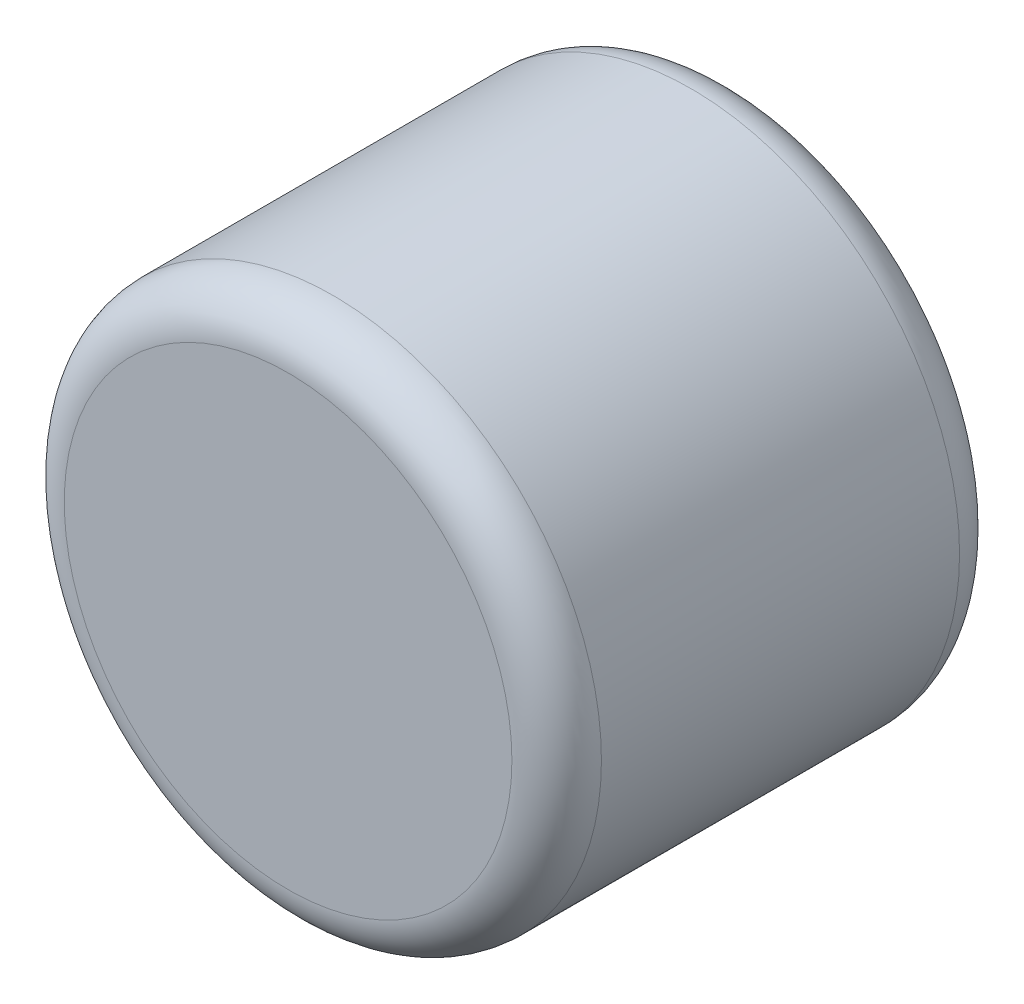
ISO-10303-21;
HEADER;
FILE_DESCRIPTION(('STEP AP214'),'2;1');
FILE_NAME('part.step','',(''),(''),'','','');
FILE_SCHEMA(('AUTOMOTIVE_DESIGN { 1 0 10303 214 1 1 1 1 }'));
ENDSEC;
DATA;
#1=APPLICATION_CONTEXT('core data for automotive mechanical design processes');
#2=APPLICATION_PROTOCOL_DEFINITION('international standard','automotive_design',2000,#1);
#3=PRODUCT_CONTEXT('',#1,'mechanical');
#4=PRODUCT('Part','Part','',(#3));
#5=PRODUCT_RELATED_PRODUCT_CATEGORY('part','',(#4));
#6=PRODUCT_DEFINITION_FORMATION('','',#4);
#7=PRODUCT_DEFINITION_CONTEXT('part definition',#1,'design');
#8=PRODUCT_DEFINITION('design','',#6,#7);
#9=PRODUCT_DEFINITION_SHAPE('','',#8);
#10=(LENGTH_UNIT() NAMED_UNIT(*) SI_UNIT(.MILLI.,.METRE.));
#11=(NAMED_UNIT(*) PLANE_ANGLE_UNIT() SI_UNIT($,.RADIAN.));
#12=(NAMED_UNIT(*) SI_UNIT($,.STERADIAN.) SOLID_ANGLE_UNIT());
#13=UNCERTAINTY_MEASURE_WITH_UNIT(LENGTH_MEASURE(1.E-05),#10,'distance_accuracy_value','');
#14=(GEOMETRIC_REPRESENTATION_CONTEXT(3) GLOBAL_UNCERTAINTY_ASSIGNED_CONTEXT((#13)) GLOBAL_UNIT_ASSIGNED_CONTEXT((#10,
#11,#12)) REPRESENTATION_CONTEXT('',''));
#15=CARTESIAN_POINT('',(0.,0.,0.));
#16=DIRECTION('',(0.,0.,1.));
#17=DIRECTION('',(1.,0.,0.));
#18=AXIS2_PLACEMENT_3D('',#15,#16,#17);
#19=CARTESIAN_POINT('',(0.,0.,127.));
#20=DIRECTION('',(0.,0.,-1.));
#21=DIRECTION('',(-1.,0.,0.));
#22=AXIS2_PLACEMENT_3D('',#19,#20,#21);
#23=CYLINDRICAL_SURFACE('',#22,76.2);
#24=CARTESIAN_POINT('',(0.,0.,12.7));
#25=DIRECTION('',(0.,0.,1.));
#26=DIRECTION('',(1.,0.,0.));
#27=AXIS2_PLACEMENT_3D('',#24,#25,#26);
#28=CIRCLE('',#27,76.2);
#29=CARTESIAN_POINT('',(76.2,0.,12.7));
#30=VERTEX_POINT('',#29);
#31=EDGE_CURVE('E62',#30,#30,#28,.T.);
#32=ORIENTED_EDGE('',*,*,#31,.T.);
#33=EDGE_LOOP('',(#32));
#34=FACE_BOUND('',#33,.T.);
#35=CARTESIAN_POINT('',(0.,0.,114.3));
#36=DIRECTION('',(0.,0.,1.));
#37=DIRECTION('',(1.,0.,0.));
#38=AXIS2_PLACEMENT_3D('',#35,#36,#37);
#39=CIRCLE('',#38,76.2);
#40=CARTESIAN_POINT('',(76.2,0.,114.3));
#41=VERTEX_POINT('',#40);
#42=EDGE_CURVE('E67',#41,#41,#39,.F.);
#43=ORIENTED_EDGE('',*,*,#42,.T.);
#44=EDGE_LOOP('',(#43));
#45=FACE_BOUND('',#44,.T.);
#46=ADVANCED_FACE('F49',(#34,#45),#23,.T.);
#47=CARTESIAN_POINT('',(0.,0.,127.));
#48=DIRECTION('',(0.,0.,1.));
#49=DIRECTION('',(1.,0.,0.));
#50=AXIS2_PLACEMENT_3D('',#47,#48,#49);
#51=PLANE('',#50);
#52=CARTESIAN_POINT('',(0.,0.,127.));
#53=DIRECTION('',(0.,0.,1.));
#54=DIRECTION('',(1.,0.,0.));
#55=AXIS2_PLACEMENT_3D('',#52,#53,#54);
#56=CIRCLE('',#55,63.5);
#57=CARTESIAN_POINT('',(63.5,0.,127.));
#58=VERTEX_POINT('',#57);
#59=EDGE_CURVE('E10',#58,#58,#56,.T.);
#60=ORIENTED_EDGE('',*,*,#59,.T.);
#61=EDGE_LOOP('',(#60));
#62=FACE_BOUND('',#61,.T.);
#63=ADVANCED_FACE('F84',(#62),#51,.T.);
#64=CARTESIAN_POINT('',(0.,0.,0.));
#65=DIRECTION('',(0.,0.,1.));
#66=DIRECTION('',(1.,0.,0.));
#67=AXIS2_PLACEMENT_3D('',#64,#65,#66);
#68=PLANE('',#67);
#69=CARTESIAN_POINT('',(0.,0.,0.));
#70=DIRECTION('',(0.,0.,1.));
#71=DIRECTION('',(1.,0.,0.));
#72=AXIS2_PLACEMENT_3D('',#69,#70,#71);
#73=CIRCLE('',#72,63.5);
#74=CARTESIAN_POINT('',(63.5,0.,0.));
#75=VERTEX_POINT('',#74);
#76=EDGE_CURVE('E57',#75,#75,#73,.F.);
#77=ORIENTED_EDGE('',*,*,#76,.T.);
#78=EDGE_LOOP('',(#77));
#79=FACE_BOUND('',#78,.T.);
#80=ADVANCED_FACE('F81',(#79),#68,.F.);
#81=CARTESIAN_POINT('',(0.,0.,12.7));
#82=DIRECTION('',(0.,0.,1.));
#83=DIRECTION('',(1.,0.,0.));
#84=AXIS2_PLACEMENT_3D('',#81,#82,#83);
#85=TOROIDAL_SURFACE('',#84,63.5,12.7);
#86=ORIENTED_EDGE('',*,*,#76,.F.);
#87=EDGE_LOOP('',(#86));
#88=FACE_BOUND('',#87,.T.);
#89=ORIENTED_EDGE('',*,*,#31,.F.);
#90=EDGE_LOOP('',(#89));
#91=FACE_BOUND('',#90,.T.);
#92=ADVANCED_FACE('F77',(#88,#91),#85,.T.);
#93=CARTESIAN_POINT('',(0.,0.,114.3));
#94=DIRECTION('',(0.,0.,1.));
#95=DIRECTION('',(1.,0.,0.));
#96=AXIS2_PLACEMENT_3D('',#93,#94,#95);
#97=TOROIDAL_SURFACE('',#96,63.5,12.7);
#98=ORIENTED_EDGE('',*,*,#42,.F.);
#99=EDGE_LOOP('',(#98));
#100=FACE_BOUND('',#99,.T.);
#101=ORIENTED_EDGE('',*,*,#59,.F.);
#102=EDGE_LOOP('',(#101));
#103=FACE_BOUND('',#102,.T.);
#104=ADVANCED_FACE('F51',(#100,#103),#97,.T.);
#105=CLOSED_SHELL('',(#46,#63,#80,#92,#104));
#106=MANIFOLD_SOLID_BREP('B2',#105);
#107=ADVANCED_BREP_SHAPE_REPRESENTATION('',(#18,#106),#14);
#108=SHAPE_DEFINITION_REPRESENTATION(#9,#107);
ENDSEC;
END-ISO-10303-21;
